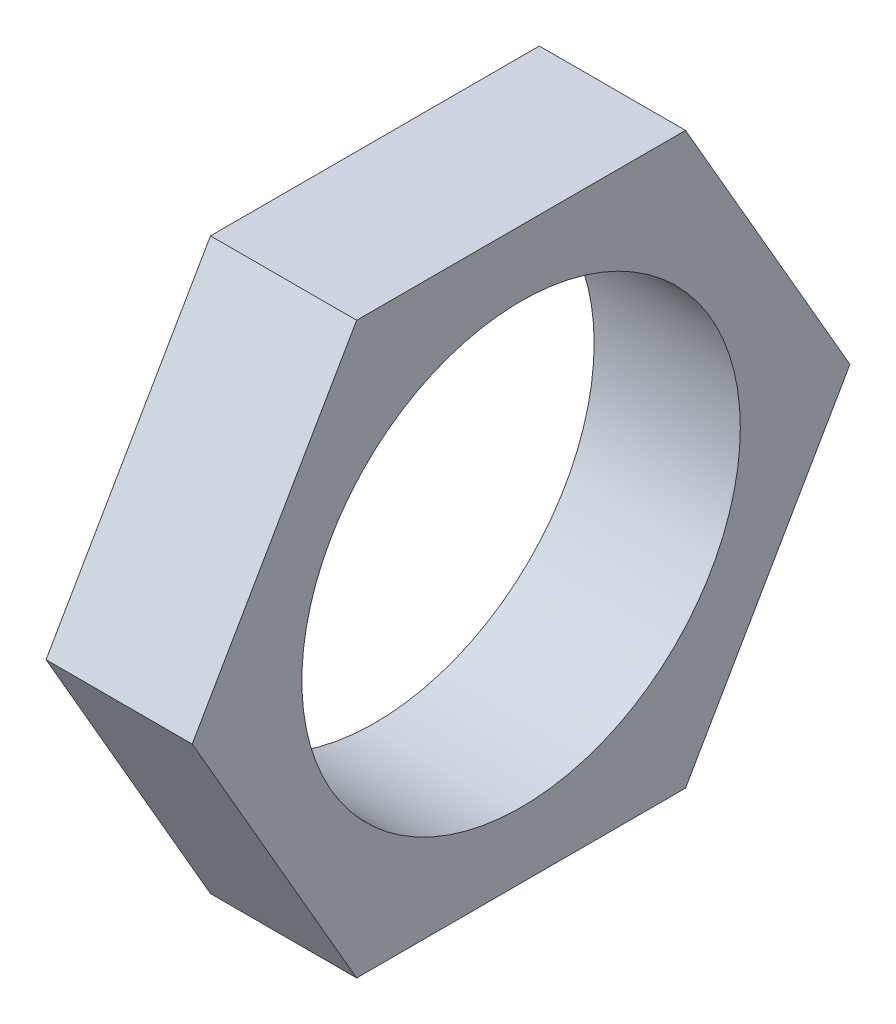
ISO-10303-21;
HEADER;
FILE_DESCRIPTION(('STEP AP214'),'2;1');
FILE_NAME('part.step','',(''),(''),'','','');
FILE_SCHEMA(('AUTOMOTIVE_DESIGN { 1 0 10303 214 1 1 1 1 }'));
ENDSEC;
DATA;
#1=APPLICATION_CONTEXT('core data for automotive mechanical design processes');
#2=APPLICATION_PROTOCOL_DEFINITION('international standard','automotive_design',2000,#1);
#3=PRODUCT_CONTEXT('',#1,'mechanical');
#4=PRODUCT('Part','Part','',(#3));
#5=PRODUCT_RELATED_PRODUCT_CATEGORY('part','',(#4));
#6=PRODUCT_DEFINITION_FORMATION('','',#4);
#7=PRODUCT_DEFINITION_CONTEXT('part definition',#1,'design');
#8=PRODUCT_DEFINITION('design','',#6,#7);
#9=PRODUCT_DEFINITION_SHAPE('','',#8);
#10=(LENGTH_UNIT() NAMED_UNIT(*) SI_UNIT(.MILLI.,.METRE.));
#11=(NAMED_UNIT(*) PLANE_ANGLE_UNIT() SI_UNIT($,.RADIAN.));
#12=(NAMED_UNIT(*) SI_UNIT($,.STERADIAN.) SOLID_ANGLE_UNIT());
#13=UNCERTAINTY_MEASURE_WITH_UNIT(LENGTH_MEASURE(1.E-05),#10,'distance_accuracy_value','');
#14=(GEOMETRIC_REPRESENTATION_CONTEXT(3) GLOBAL_UNCERTAINTY_ASSIGNED_CONTEXT((#13)) GLOBAL_UNIT_ASSIGNED_CONTEXT((#10,
#11,#12)) REPRESENTATION_CONTEXT('',''));
#15=CARTESIAN_POINT('',(0.,0.,0.));
#16=DIRECTION('',(0.,0.,1.));
#17=DIRECTION('',(1.,0.,0.));
#18=AXIS2_PLACEMENT_3D('',#15,#16,#17);
#19=CARTESIAN_POINT('',(20.,0.,0.));
#20=DIRECTION('',(1.,0.,0.));
#21=DIRECTION('',(0.,0.,-1.));
#22=AXIS2_PLACEMENT_3D('',#19,#20,#21);
#23=PLANE('',#22);
#24=DIRECTION('',(0.,0.866025403784441,-0.499999999999995));
#25=VECTOR('',#24,1.);
#26=CARTESIAN_POINT('',(20.,-38.9711431702995,-22.5000000000005));
#27=LINE('',#26,#25);
#28=CARTESIAN_POINT('',(20.,-38.9711431702995,-22.5000000000005));
#29=VERTEX_POINT('',#28);
#30=CARTESIAN_POINT('',(20.,0.,-45.));
#31=VERTEX_POINT('',#30);
#32=EDGE_CURVE('E128',#29,#31,#27,.T.);
#33=ORIENTED_EDGE('',*,*,#32,.T.);
#34=DIRECTION('',(0.,0.866025403784438,0.500000000000001));
#35=VECTOR('',#34,1.);
#36=CARTESIAN_POINT('',(20.,0.,-45.));
#37=LINE('',#36,#35);
#38=CARTESIAN_POINT('',(20.,38.9711431702998,-22.4999999999999));
#39=VERTEX_POINT('',#38);
#40=EDGE_CURVE('E86',#31,#39,#37,.T.);
#41=ORIENTED_EDGE('',*,*,#40,.T.);
#42=DIRECTION('',(0.,0.,1.));
#43=VECTOR('',#42,1.);
#44=CARTESIAN_POINT('',(20.,38.9711431702998,-22.4999999999999));
#45=LINE('',#44,#43);
#46=CARTESIAN_POINT('',(20.,38.9711431702996,22.5000000000002));
#47=VERTEX_POINT('',#46);
#48=EDGE_CURVE('E99',#39,#47,#45,.T.);
#49=ORIENTED_EDGE('',*,*,#48,.T.);
#50=DIRECTION('',(0.,-0.866025403784441,0.499999999999995));
#51=VECTOR('',#50,1.);
#52=CARTESIAN_POINT('',(20.,38.9711431702996,22.5000000000002));
#53=LINE('',#52,#51);
#54=CARTESIAN_POINT('',(20.,-3.14233320495882E-13,45.));
#55=VERTEX_POINT('',#54);
#56=EDGE_CURVE('E93',#47,#55,#53,.T.);
#57=ORIENTED_EDGE('',*,*,#56,.T.);
#58=DIRECTION('',(0.,-0.866025403784435,-0.500000000000007));
#59=VECTOR('',#58,1.);
#60=CARTESIAN_POINT('',(20.,-3.14233320495882E-13,45.));
#61=LINE('',#60,#59);
#62=CARTESIAN_POINT('',(20.,-38.9711431702999,22.4999999999996));
#63=VERTEX_POINT('',#62);
#64=EDGE_CURVE('E97',#55,#63,#61,.T.);
#65=ORIENTED_EDGE('',*,*,#64,.T.);
#66=DIRECTION('',(0.,0.,-1.));
#67=VECTOR('',#66,1.);
#68=CARTESIAN_POINT('',(20.,-38.9711431702999,22.4999999999996));
#69=LINE('',#68,#67);
#70=EDGE_CURVE('E49',#63,#29,#69,.T.);
#71=ORIENTED_EDGE('',*,*,#70,.T.);
#72=EDGE_LOOP('',(#33,#41,#49,#57,#65,#71));
#73=FACE_BOUND('',#72,.T.);
#74=CARTESIAN_POINT('',(20.,0.,0.));
#75=DIRECTION('',(1.,0.,0.));
#76=DIRECTION('',(0.,0.,-1.));
#77=AXIS2_PLACEMENT_3D('',#74,#75,#76);
#78=CIRCLE('',#77,30.);
#79=CARTESIAN_POINT('',(20.,0.,-30.));
#80=VERTEX_POINT('',#79);
#81=EDGE_CURVE('E121',#80,#80,#78,.T.);
#82=ORIENTED_EDGE('',*,*,#81,.F.);
#83=EDGE_LOOP('',(#82));
#84=FACE_BOUND('',#83,.T.);
#85=ADVANCED_FACE('F32',(#73,#84),#23,.T.);
#86=CARTESIAN_POINT('',(0.,0.,0.));
#87=DIRECTION('',(1.,0.,0.));
#88=DIRECTION('',(0.,0.,-1.));
#89=AXIS2_PLACEMENT_3D('',#86,#87,#88);
#90=PLANE('',#89);
#91=DIRECTION('',(0.,0.866025403784441,-0.499999999999995));
#92=VECTOR('',#91,1.);
#93=CARTESIAN_POINT('',(0.,-38.9711431702995,-22.5000000000005));
#94=LINE('',#93,#92);
#95=CARTESIAN_POINT('',(0.,-38.9711431702995,-22.5000000000005));
#96=VERTEX_POINT('',#95);
#97=CARTESIAN_POINT('',(0.,0.,-45.));
#98=VERTEX_POINT('',#97);
#99=EDGE_CURVE('E117',#96,#98,#94,.T.);
#100=ORIENTED_EDGE('',*,*,#99,.F.);
#101=DIRECTION('',(0.,0.,-1.));
#102=VECTOR('',#101,1.);
#103=CARTESIAN_POINT('',(0.,-38.9711431702999,22.4999999999996));
#104=LINE('',#103,#102);
#105=CARTESIAN_POINT('',(0.,-38.9711431702999,22.4999999999996));
#106=VERTEX_POINT('',#105);
#107=EDGE_CURVE('E78',#106,#96,#104,.T.);
#108=ORIENTED_EDGE('',*,*,#107,.F.);
#109=DIRECTION('',(0.,-0.866025403784435,-0.500000000000007));
#110=VECTOR('',#109,1.);
#111=CARTESIAN_POINT('',(0.,-3.14233320495882E-13,45.));
#112=LINE('',#111,#110);
#113=CARTESIAN_POINT('',(0.,-3.14233320495882E-13,45.));
#114=VERTEX_POINT('',#113);
#115=EDGE_CURVE('E72',#114,#106,#112,.T.);
#116=ORIENTED_EDGE('',*,*,#115,.F.);
#117=DIRECTION('',(0.,-0.866025403784441,0.499999999999995));
#118=VECTOR('',#117,1.);
#119=CARTESIAN_POINT('',(0.,38.9711431702996,22.5000000000002));
#120=LINE('',#119,#118);
#121=CARTESIAN_POINT('',(0.,38.9711431702996,22.5000000000002));
#122=VERTEX_POINT('',#121);
#123=EDGE_CURVE('E107',#122,#114,#120,.T.);
#124=ORIENTED_EDGE('',*,*,#123,.F.);
#125=DIRECTION('',(0.,0.,1.));
#126=VECTOR('',#125,1.);
#127=CARTESIAN_POINT('',(0.,38.9711431702998,-22.4999999999999));
#128=LINE('',#127,#126);
#129=CARTESIAN_POINT('',(0.,38.9711431702998,-22.4999999999999));
#130=VERTEX_POINT('',#129);
#131=EDGE_CURVE('E123',#130,#122,#128,.T.);
#132=ORIENTED_EDGE('',*,*,#131,.F.);
#133=DIRECTION('',(0.,0.866025403784438,0.500000000000001));
#134=VECTOR('',#133,1.);
#135=CARTESIAN_POINT('',(0.,0.,-45.));
#136=LINE('',#135,#134);
#137=EDGE_CURVE('E120',#98,#130,#136,.T.);
#138=ORIENTED_EDGE('',*,*,#137,.F.);
#139=EDGE_LOOP('',(#100,#108,#116,#124,#132,#138));
#140=FACE_BOUND('',#139,.T.);
#141=CARTESIAN_POINT('',(0.,0.,0.));
#142=DIRECTION('',(1.,0.,0.));
#143=DIRECTION('',(0.,0.,-1.));
#144=AXIS2_PLACEMENT_3D('',#141,#142,#143);
#145=CIRCLE('',#144,30.);
#146=CARTESIAN_POINT('',(0.,0.,-30.));
#147=VERTEX_POINT('',#146);
#148=EDGE_CURVE('E221',#147,#147,#145,.T.);
#149=ORIENTED_EDGE('',*,*,#148,.T.);
#150=EDGE_LOOP('',(#149));
#151=FACE_BOUND('',#150,.T.);
#152=ADVANCED_FACE('F137',(#140,#151),#90,.F.);
#153=CARTESIAN_POINT('',(20.,-38.9711431702995,-22.5000000000005));
#154=DIRECTION('',(0.,0.499999999999995,0.866025403784442));
#155=DIRECTION('',(0.,-0.866025403784442,0.499999999999995));
#156=AXIS2_PLACEMENT_3D('',#153,#154,#155);
#157=PLANE('',#156);
#158=ORIENTED_EDGE('',*,*,#99,.T.);
#159=DIRECTION('',(-1.,0.,0.));
#160=VECTOR('',#159,1.);
#161=CARTESIAN_POINT('',(20.,0.,-45.));
#162=LINE('',#161,#160);
#163=EDGE_CURVE('E11',#31,#98,#162,.T.);
#164=ORIENTED_EDGE('',*,*,#163,.F.);
#165=ORIENTED_EDGE('',*,*,#32,.F.);
#166=DIRECTION('',(-1.,0.,0.));
#167=VECTOR('',#166,1.);
#168=CARTESIAN_POINT('',(20.,-38.9711431702995,-22.5000000000005));
#169=LINE('',#168,#167);
#170=EDGE_CURVE('E113',#29,#96,#169,.T.);
#171=ORIENTED_EDGE('',*,*,#170,.T.);
#172=EDGE_LOOP('',(#158,#164,#165,#171));
#173=FACE_BOUND('',#172,.T.);
#174=ADVANCED_FACE('F34',(#173),#157,.F.);
#175=CARTESIAN_POINT('',(20.,0.,-45.));
#176=DIRECTION('',(0.,-0.500000000000001,0.866025403784438));
#177=DIRECTION('',(0.,-0.866025403784438,-0.500000000000001));
#178=AXIS2_PLACEMENT_3D('',#175,#176,#177);
#179=PLANE('',#178);
#180=ORIENTED_EDGE('',*,*,#137,.T.);
#181=DIRECTION('',(-1.,0.,0.));
#182=VECTOR('',#181,1.);
#183=CARTESIAN_POINT('',(20.,38.9711431702998,-22.4999999999999));
#184=LINE('',#183,#182);
#185=EDGE_CURVE('E41',#39,#130,#184,.T.);
#186=ORIENTED_EDGE('',*,*,#185,.F.);
#187=ORIENTED_EDGE('',*,*,#40,.F.);
#188=ORIENTED_EDGE('',*,*,#163,.T.);
#189=EDGE_LOOP('',(#180,#186,#187,#188));
#190=FACE_BOUND('',#189,.T.);
#191=ADVANCED_FACE('F162',(#190),#179,.F.);
#192=CARTESIAN_POINT('',(20.,38.9711431702998,-22.4999999999999));
#193=DIRECTION('',(0.,-1.,0.));
#194=DIRECTION('',(0.,0.,-1.));
#195=AXIS2_PLACEMENT_3D('',#192,#193,#194);
#196=PLANE('',#195);
#197=ORIENTED_EDGE('',*,*,#131,.T.);
#198=DIRECTION('',(-1.,0.,0.));
#199=VECTOR('',#198,1.);
#200=CARTESIAN_POINT('',(20.,38.9711431702996,22.5000000000002));
#201=LINE('',#200,#199);
#202=EDGE_CURVE('E108',#47,#122,#201,.T.);
#203=ORIENTED_EDGE('',*,*,#202,.F.);
#204=ORIENTED_EDGE('',*,*,#48,.F.);
#205=ORIENTED_EDGE('',*,*,#185,.T.);
#206=EDGE_LOOP('',(#197,#203,#204,#205));
#207=FACE_BOUND('',#206,.T.);
#208=ADVANCED_FACE('F134',(#207),#196,.F.);
#209=CARTESIAN_POINT('',(20.,38.9711431702996,22.5000000000002));
#210=DIRECTION('',(0.,-0.499999999999995,-0.866025403784442));
#211=DIRECTION('',(0.,0.866025403784442,-0.499999999999995));
#212=AXIS2_PLACEMENT_3D('',#209,#210,#211);
#213=PLANE('',#212);
#214=ORIENTED_EDGE('',*,*,#123,.T.);
#215=DIRECTION('',(-1.,0.,0.));
#216=VECTOR('',#215,1.);
#217=CARTESIAN_POINT('',(20.,-3.14233320495882E-13,45.));
#218=LINE('',#217,#216);
#219=EDGE_CURVE('E104',#55,#114,#218,.T.);
#220=ORIENTED_EDGE('',*,*,#219,.F.);
#221=ORIENTED_EDGE('',*,*,#56,.F.);
#222=ORIENTED_EDGE('',*,*,#202,.T.);
#223=EDGE_LOOP('',(#214,#220,#221,#222));
#224=FACE_BOUND('',#223,.T.);
#225=ADVANCED_FACE('F105',(#224),#213,.F.);
#226=CARTESIAN_POINT('',(20.,-3.14233320495882E-13,45.));
#227=DIRECTION('',(0.,0.500000000000007,-0.866025403784434));
#228=DIRECTION('',(0.,0.866025403784435,0.500000000000007));
#229=AXIS2_PLACEMENT_3D('',#226,#227,#228);
#230=PLANE('',#229);
#231=ORIENTED_EDGE('',*,*,#115,.T.);
#232=DIRECTION('',(-1.,0.,0.));
#233=VECTOR('',#232,1.);
#234=CARTESIAN_POINT('',(20.,-38.9711431702999,22.4999999999996));
#235=LINE('',#234,#233);
#236=EDGE_CURVE('E109',#63,#106,#235,.T.);
#237=ORIENTED_EDGE('',*,*,#236,.F.);
#238=ORIENTED_EDGE('',*,*,#64,.F.);
#239=ORIENTED_EDGE('',*,*,#219,.T.);
#240=EDGE_LOOP('',(#231,#237,#238,#239));
#241=FACE_BOUND('',#240,.T.);
#242=ADVANCED_FACE('F111',(#241),#230,.F.);
#243=CARTESIAN_POINT('',(20.,-38.9711431702999,22.4999999999996));
#244=DIRECTION('',(0.,1.,0.));
#245=DIRECTION('',(0.,0.,1.));
#246=AXIS2_PLACEMENT_3D('',#243,#244,#245);
#247=PLANE('',#246);
#248=ORIENTED_EDGE('',*,*,#107,.T.);
#249=ORIENTED_EDGE('',*,*,#170,.F.);
#250=ORIENTED_EDGE('',*,*,#70,.F.);
#251=ORIENTED_EDGE('',*,*,#236,.T.);
#252=EDGE_LOOP('',(#248,#249,#250,#251));
#253=FACE_BOUND('',#252,.T.);
#254=ADVANCED_FACE('F142',(#253),#247,.F.);
#255=CARTESIAN_POINT('',(20.,0.,0.));
#256=DIRECTION('',(-1.,0.,0.));
#257=DIRECTION('',(0.,0.,1.));
#258=AXIS2_PLACEMENT_3D('',#255,#256,#257);
#259=CYLINDRICAL_SURFACE('',#258,30.);
#260=ORIENTED_EDGE('',*,*,#81,.T.);
#261=EDGE_LOOP('',(#260));
#262=FACE_BOUND('',#261,.T.);
#263=ORIENTED_EDGE('',*,*,#148,.F.);
#264=EDGE_LOOP('',(#263));
#265=FACE_BOUND('',#264,.T.);
#266=ADVANCED_FACE('F144',(#262,#265),#259,.F.);
#267=CLOSED_SHELL('',(#85,#152,#174,#191,#208,#225,#242,#254,#266));
#268=MANIFOLD_SOLID_BREP('B2',#267);
#269=ADVANCED_BREP_SHAPE_REPRESENTATION('',(#18,#268),#14);
#270=SHAPE_DEFINITION_REPRESENTATION(#9,#269);
ENDSEC;
END-ISO-10303-21;
